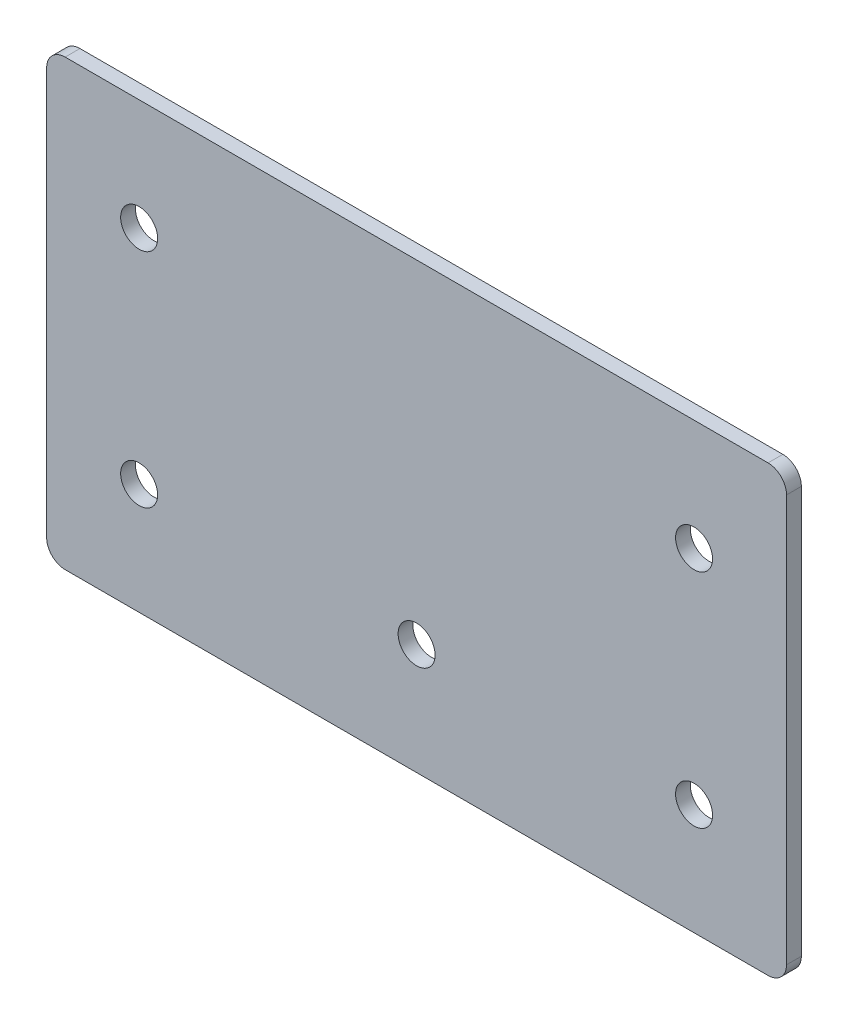
ISO-10303-21;
HEADER;
FILE_DESCRIPTION(('STEP AP214'),'2;1');
FILE_NAME('part.step','',(''),(''),'','','');
FILE_SCHEMA(('AUTOMOTIVE_DESIGN { 1 0 10303 214 1 1 1 1 }'));
ENDSEC;
DATA;
#1=APPLICATION_CONTEXT('core data for automotive mechanical design processes');
#2=APPLICATION_PROTOCOL_DEFINITION('international standard','automotive_design',2000,#1);
#3=PRODUCT_CONTEXT('',#1,'mechanical');
#4=PRODUCT('Part','Part','',(#3));
#5=PRODUCT_RELATED_PRODUCT_CATEGORY('part','',(#4));
#6=PRODUCT_DEFINITION_FORMATION('','',#4);
#7=PRODUCT_DEFINITION_CONTEXT('part definition',#1,'design');
#8=PRODUCT_DEFINITION('design','',#6,#7);
#9=PRODUCT_DEFINITION_SHAPE('','',#8);
#10=(LENGTH_UNIT() NAMED_UNIT(*) SI_UNIT(.MILLI.,.METRE.));
#11=(NAMED_UNIT(*) PLANE_ANGLE_UNIT() SI_UNIT($,.RADIAN.));
#12=(NAMED_UNIT(*) SI_UNIT($,.STERADIAN.) SOLID_ANGLE_UNIT());
#13=UNCERTAINTY_MEASURE_WITH_UNIT(LENGTH_MEASURE(1.E-05),#10,'distance_accuracy_value','');
#14=(GEOMETRIC_REPRESENTATION_CONTEXT(3) GLOBAL_UNCERTAINTY_ASSIGNED_CONTEXT((#13)) GLOBAL_UNIT_ASSIGNED_CONTEXT((#10,
#11,#12)) REPRESENTATION_CONTEXT('',''));
#15=CARTESIAN_POINT('',(0.,0.,0.));
#16=DIRECTION('',(0.,0.,1.));
#17=DIRECTION('',(1.,0.,0.));
#18=AXIS2_PLACEMENT_3D('',#15,#16,#17);
#19=CARTESIAN_POINT('',(0.,0.,16.7000000000001));
#20=DIRECTION('',(0.,0.,-1.));
#21=DIRECTION('',(-1.,0.,0.));
#22=AXIS2_PLACEMENT_3D('',#19,#20,#21);
#23=PLANE('',#22);
#24=DIRECTION('',(0.,1.,0.));
#25=VECTOR('',#24,1.);
#26=CARTESIAN_POINT('',(1066.080087664,115.697979581785,16.7000000000001));
#27=LINE('',#26,#25);
#28=CARTESIAN_POINT('',(1066.080087664,120.697979581785,16.7000000000001));
#29=VERTEX_POINT('',#28);
#30=CARTESIAN_POINT('',(1066.080087664,230.697979581784,16.7000000000001));
#31=VERTEX_POINT('',#30);
#32=EDGE_CURVE('E165',#29,#31,#27,.T.);
#33=ORIENTED_EDGE('',*,*,#32,.T.);
#34=CARTESIAN_POINT('',(1061.080087664,230.697979581784,16.7000000000001));
#35=DIRECTION('',(0.,0.,-1.));
#36=DIRECTION('',(-1.,0.,0.));
#37=AXIS2_PLACEMENT_3D('',#34,#35,#36);
#38=CIRCLE('',#37,5.);
#39=CARTESIAN_POINT('',(1061.080087664,235.697979581784,16.7000000000001));
#40=VERTEX_POINT('',#39);
#41=EDGE_CURVE('E148',#31,#40,#38,.F.);
#42=ORIENTED_EDGE('',*,*,#41,.T.);
#43=DIRECTION('',(-1.,0.,0.));
#44=VECTOR('',#43,1.);
#45=CARTESIAN_POINT('',(866.08010083132,235.697979581784,16.7000000000001));
#46=LINE('',#45,#44);
#47=CARTESIAN_POINT('',(871.08010083132,235.697979581784,16.7000000000001));
#48=VERTEX_POINT('',#47);
#49=EDGE_CURVE('E119',#40,#48,#46,.T.);
#50=ORIENTED_EDGE('',*,*,#49,.T.);
#51=CARTESIAN_POINT('',(871.08010083132,230.697979581784,16.7000000000001));
#52=DIRECTION('',(0.,0.,-1.));
#53=DIRECTION('',(-1.,0.,0.));
#54=AXIS2_PLACEMENT_3D('',#51,#52,#53);
#55=CIRCLE('',#54,5.);
#56=CARTESIAN_POINT('',(866.08010083132,230.697979581784,16.7000000000001));
#57=VERTEX_POINT('',#56);
#58=EDGE_CURVE('E146',#48,#57,#55,.F.);
#59=ORIENTED_EDGE('',*,*,#58,.T.);
#60=DIRECTION('',(0.,-1.,0.));
#61=VECTOR('',#60,1.);
#62=CARTESIAN_POINT('',(866.08010083132,115.697979581785,16.7000000000001));
#63=LINE('',#62,#61);
#64=CARTESIAN_POINT('',(866.08010083132,120.697979581785,16.7000000000001));
#65=VERTEX_POINT('',#64);
#66=EDGE_CURVE('E126',#57,#65,#63,.T.);
#67=ORIENTED_EDGE('',*,*,#66,.T.);
#68=CARTESIAN_POINT('',(871.08010083132,120.697979581785,16.7000000000001));
#69=DIRECTION('',(0.,0.,-1.));
#70=DIRECTION('',(-1.,0.,0.));
#71=AXIS2_PLACEMENT_3D('',#68,#69,#70);
#72=CIRCLE('',#71,5.);
#73=CARTESIAN_POINT('',(871.08010083132,115.697979581785,16.7000000000001));
#74=VERTEX_POINT('',#73);
#75=EDGE_CURVE('E54',#65,#74,#72,.F.);
#76=ORIENTED_EDGE('',*,*,#75,.T.);
#77=DIRECTION('',(1.,0.,0.));
#78=VECTOR('',#77,1.);
#79=CARTESIAN_POINT('',(866.08010083132,115.697979581785,16.7000000000001));
#80=LINE('',#79,#78);
#81=CARTESIAN_POINT('',(1061.080087664,115.697979581785,16.7000000000001));
#82=VERTEX_POINT('',#81);
#83=EDGE_CURVE('E129',#74,#82,#80,.T.);
#84=ORIENTED_EDGE('',*,*,#83,.T.);
#85=CARTESIAN_POINT('',(1061.080087664,120.697979581785,16.7000000000001));
#86=DIRECTION('',(0.,0.,-1.));
#87=DIRECTION('',(-1.,0.,0.));
#88=AXIS2_PLACEMENT_3D('',#85,#86,#87);
#89=CIRCLE('',#88,5.);
#90=EDGE_CURVE('E144',#82,#29,#89,.F.);
#91=ORIENTED_EDGE('',*,*,#90,.T.);
#92=EDGE_LOOP('',(#33,#42,#50,#59,#67,#76,#84,#91));
#93=FACE_BOUND('',#92,.T.);
#94=CARTESIAN_POINT('',(891.080087664001,205.697979581784,16.7000000000001));
#95=DIRECTION('',(0.,0.,1.));
#96=DIRECTION('',(1.,0.,0.));
#97=AXIS2_PLACEMENT_3D('',#94,#95,#96);
#98=CIRCLE('',#97,5.00000000000017);
#99=CARTESIAN_POINT('',(896.080087664001,205.697979581784,16.7000000000001));
#100=VERTEX_POINT('',#99);
#101=EDGE_CURVE('E161',#100,#100,#98,.T.);
#102=ORIENTED_EDGE('',*,*,#101,.F.);
#103=EDGE_LOOP('',(#102));
#104=FACE_BOUND('',#103,.T.);
#105=CARTESIAN_POINT('',(1041.080087664,205.697979581784,16.7000000000001));
#106=DIRECTION('',(0.,0.,1.));
#107=DIRECTION('',(1.,0.,0.));
#108=AXIS2_PLACEMENT_3D('',#105,#106,#107);
#109=CIRCLE('',#108,5.00000000000007);
#110=CARTESIAN_POINT('',(1046.080087664,205.697979581784,16.7000000000001));
#111=VERTEX_POINT('',#110);
#112=EDGE_CURVE('E172',#111,#111,#109,.T.);
#113=ORIENTED_EDGE('',*,*,#112,.F.);
#114=EDGE_LOOP('',(#113));
#115=FACE_BOUND('',#114,.T.);
#116=CARTESIAN_POINT('',(891.080087664,145.697979581784,16.7000000000001));
#117=DIRECTION('',(0.,0.,1.));
#118=DIRECTION('',(1.,0.,0.));
#119=AXIS2_PLACEMENT_3D('',#116,#117,#118);
#120=CIRCLE('',#119,5.00000000000006);
#121=CARTESIAN_POINT('',(896.080087664,145.697979581784,16.7000000000001));
#122=VERTEX_POINT('',#121);
#123=EDGE_CURVE('E178',#122,#122,#120,.T.);
#124=ORIENTED_EDGE('',*,*,#123,.F.);
#125=EDGE_LOOP('',(#124));
#126=FACE_BOUND('',#125,.T.);
#127=CARTESIAN_POINT('',(966.080087664,145.697979581784,16.7000000000001));
#128=DIRECTION('',(0.,0.,1.));
#129=DIRECTION('',(1.,0.,0.));
#130=AXIS2_PLACEMENT_3D('',#127,#128,#129);
#131=CIRCLE('',#130,5.00000000000006);
#132=CARTESIAN_POINT('',(971.080087664,145.697979581784,16.7000000000001));
#133=VERTEX_POINT('',#132);
#134=EDGE_CURVE('E184',#133,#133,#131,.T.);
#135=ORIENTED_EDGE('',*,*,#134,.F.);
#136=EDGE_LOOP('',(#135));
#137=FACE_BOUND('',#136,.T.);
#138=CARTESIAN_POINT('',(1041.080087664,145.697979581784,16.7000000000001));
#139=DIRECTION('',(0.,0.,1.));
#140=DIRECTION('',(1.,0.,0.));
#141=AXIS2_PLACEMENT_3D('',#138,#139,#140);
#142=CIRCLE('',#141,5.00000000000007);
#143=CARTESIAN_POINT('',(1046.080087664,145.697979581784,16.7000000000001));
#144=VERTEX_POINT('',#143);
#145=EDGE_CURVE('E190',#144,#144,#142,.T.);
#146=ORIENTED_EDGE('',*,*,#145,.F.);
#147=EDGE_LOOP('',(#146));
#148=FACE_BOUND('',#147,.T.);
#149=ADVANCED_FACE('F34',(#93,#104,#115,#126,#137,#148),#23,.F.);
#150=CARTESIAN_POINT('',(0.,0.,12.7000000000001));
#151=DIRECTION('',(0.,0.,-1.));
#152=DIRECTION('',(-1.,0.,0.));
#153=AXIS2_PLACEMENT_3D('',#150,#151,#152);
#154=PLANE('',#153);
#155=CARTESIAN_POINT('',(966.080087664,145.697979581784,12.7000000000001));
#156=DIRECTION('',(0.,0.,1.));
#157=DIRECTION('',(1.,0.,0.));
#158=AXIS2_PLACEMENT_3D('',#155,#156,#157);
#159=CIRCLE('',#158,5.00000000000006);
#160=CARTESIAN_POINT('',(971.080087664,145.697979581784,12.7000000000001));
#161=VERTEX_POINT('',#160);
#162=EDGE_CURVE('E187',#161,#161,#159,.T.);
#163=ORIENTED_EDGE('',*,*,#162,.T.);
#164=EDGE_LOOP('',(#163));
#165=FACE_BOUND('',#164,.T.);
#166=CARTESIAN_POINT('',(1041.080087664,205.697979581784,12.7000000000001));
#167=DIRECTION('',(0.,0.,1.));
#168=DIRECTION('',(1.,0.,0.));
#169=AXIS2_PLACEMENT_3D('',#166,#167,#168);
#170=CIRCLE('',#169,5.00000000000007);
#171=CARTESIAN_POINT('',(1046.080087664,205.697979581784,12.7000000000001));
#172=VERTEX_POINT('',#171);
#173=EDGE_CURVE('E175',#172,#172,#170,.T.);
#174=ORIENTED_EDGE('',*,*,#173,.T.);
#175=EDGE_LOOP('',(#174));
#176=FACE_BOUND('',#175,.T.);
#177=DIRECTION('',(-1.,0.,0.));
#178=VECTOR('',#177,1.);
#179=CARTESIAN_POINT('',(866.08010083132,235.697979581784,12.7000000000001));
#180=LINE('',#179,#178);
#181=CARTESIAN_POINT('',(1061.080087664,235.697979581784,12.7000000000001));
#182=VERTEX_POINT('',#181);
#183=CARTESIAN_POINT('',(871.08010083132,235.697979581784,12.7000000000001));
#184=VERTEX_POINT('',#183);
#185=EDGE_CURVE('E116',#182,#184,#180,.T.);
#186=ORIENTED_EDGE('',*,*,#185,.F.);
#187=CARTESIAN_POINT('',(1061.080087664,230.697979581784,12.7000000000001));
#188=DIRECTION('',(0.,0.,-1.));
#189=DIRECTION('',(-1.,0.,0.));
#190=AXIS2_PLACEMENT_3D('',#187,#188,#189);
#191=CIRCLE('',#190,5.);
#192=CARTESIAN_POINT('',(1066.080087664,230.697979581784,12.7000000000001));
#193=VERTEX_POINT('',#192);
#194=EDGE_CURVE('E99',#182,#193,#191,.T.);
#195=ORIENTED_EDGE('',*,*,#194,.T.);
#196=DIRECTION('',(0.,1.,0.));
#197=VECTOR('',#196,1.);
#198=CARTESIAN_POINT('',(1066.080087664,115.697979581785,12.7000000000001));
#199=LINE('',#198,#197);
#200=CARTESIAN_POINT('',(1066.080087664,120.697979581785,12.7000000000001));
#201=VERTEX_POINT('',#200);
#202=EDGE_CURVE('E127',#201,#193,#199,.T.);
#203=ORIENTED_EDGE('',*,*,#202,.F.);
#204=CARTESIAN_POINT('',(1061.080087664,120.697979581785,12.7000000000001));
#205=DIRECTION('',(0.,0.,-1.));
#206=DIRECTION('',(-1.,0.,0.));
#207=AXIS2_PLACEMENT_3D('',#204,#205,#206);
#208=CIRCLE('',#207,5.);
#209=CARTESIAN_POINT('',(1061.080087664,115.697979581785,12.7000000000001));
#210=VERTEX_POINT('',#209);
#211=EDGE_CURVE('E137',#201,#210,#208,.T.);
#212=ORIENTED_EDGE('',*,*,#211,.T.);
#213=DIRECTION('',(1.,0.,0.));
#214=VECTOR('',#213,1.);
#215=CARTESIAN_POINT('',(866.08010083132,115.697979581785,12.7000000000001));
#216=LINE('',#215,#214);
#217=CARTESIAN_POINT('',(871.08010083132,115.697979581785,12.7000000000001));
#218=VERTEX_POINT('',#217);
#219=EDGE_CURVE('E131',#218,#210,#216,.T.);
#220=ORIENTED_EDGE('',*,*,#219,.F.);
#221=CARTESIAN_POINT('',(871.08010083132,120.697979581785,12.7000000000001));
#222=DIRECTION('',(0.,0.,-1.));
#223=DIRECTION('',(-1.,0.,0.));
#224=AXIS2_PLACEMENT_3D('',#221,#222,#223);
#225=CIRCLE('',#224,5.);
#226=CARTESIAN_POINT('',(866.08010083132,120.697979581785,12.7000000000001));
#227=VERTEX_POINT('',#226);
#228=EDGE_CURVE('E120',#218,#227,#225,.T.);
#229=ORIENTED_EDGE('',*,*,#228,.T.);
#230=DIRECTION('',(0.,-1.,0.));
#231=VECTOR('',#230,1.);
#232=CARTESIAN_POINT('',(866.08010083132,115.697979581785,12.7000000000001));
#233=LINE('',#232,#231);
#234=CARTESIAN_POINT('',(866.08010083132,230.697979581784,12.7000000000001));
#235=VERTEX_POINT('',#234);
#236=EDGE_CURVE('E160',#235,#227,#233,.T.);
#237=ORIENTED_EDGE('',*,*,#236,.F.);
#238=CARTESIAN_POINT('',(871.08010083132,230.697979581784,12.7000000000001));
#239=DIRECTION('',(0.,0.,-1.));
#240=DIRECTION('',(-1.,0.,0.));
#241=AXIS2_PLACEMENT_3D('',#238,#239,#240);
#242=CIRCLE('',#241,5.);
#243=EDGE_CURVE('E110',#235,#184,#242,.T.);
#244=ORIENTED_EDGE('',*,*,#243,.T.);
#245=EDGE_LOOP('',(#186,#195,#203,#212,#220,#229,#237,#244));
#246=FACE_BOUND('',#245,.T.);
#247=CARTESIAN_POINT('',(891.080087664001,205.697979581784,12.7000000000001));
#248=DIRECTION('',(0.,0.,1.));
#249=DIRECTION('',(1.,0.,0.));
#250=AXIS2_PLACEMENT_3D('',#247,#248,#249);
#251=CIRCLE('',#250,5.00000000000017);
#252=CARTESIAN_POINT('',(896.080087664001,205.697979581784,12.7000000000001));
#253=VERTEX_POINT('',#252);
#254=EDGE_CURVE('E169',#253,#253,#251,.T.);
#255=ORIENTED_EDGE('',*,*,#254,.T.);
#256=EDGE_LOOP('',(#255));
#257=FACE_BOUND('',#256,.T.);
#258=CARTESIAN_POINT('',(891.080087664,145.697979581784,12.7000000000001));
#259=DIRECTION('',(0.,0.,1.));
#260=DIRECTION('',(1.,0.,0.));
#261=AXIS2_PLACEMENT_3D('',#258,#259,#260);
#262=CIRCLE('',#261,5.00000000000006);
#263=CARTESIAN_POINT('',(896.080087664,145.697979581784,12.7000000000001));
#264=VERTEX_POINT('',#263);
#265=EDGE_CURVE('E181',#264,#264,#262,.T.);
#266=ORIENTED_EDGE('',*,*,#265,.T.);
#267=EDGE_LOOP('',(#266));
#268=FACE_BOUND('',#267,.T.);
#269=CARTESIAN_POINT('',(1041.080087664,145.697979581784,12.7000000000001));
#270=DIRECTION('',(0.,0.,1.));
#271=DIRECTION('',(1.,0.,0.));
#272=AXIS2_PLACEMENT_3D('',#269,#270,#271);
#273=CIRCLE('',#272,5.00000000000007);
#274=CARTESIAN_POINT('',(1046.080087664,145.697979581784,12.7000000000001));
#275=VERTEX_POINT('',#274);
#276=EDGE_CURVE('E193',#275,#275,#273,.T.);
#277=ORIENTED_EDGE('',*,*,#276,.T.);
#278=EDGE_LOOP('',(#277));
#279=FACE_BOUND('',#278,.T.);
#280=ADVANCED_FACE('F123',(#165,#176,#246,#257,#268,#279),#154,.T.);
#281=CARTESIAN_POINT('',(866.08010083132,115.697979581785,16.7000000000001));
#282=DIRECTION('',(1.,0.,0.));
#283=DIRECTION('',(0.,0.,-1.));
#284=AXIS2_PLACEMENT_3D('',#281,#282,#283);
#285=PLANE('',#284);
#286=ORIENTED_EDGE('',*,*,#66,.F.);
#287=DIRECTION('',(0.,0.,-1.));
#288=VECTOR('',#287,1.);
#289=CARTESIAN_POINT('',(866.08010083132,230.697979581784,16.7000000000001));
#290=LINE('',#289,#288);
#291=EDGE_CURVE('E152',#57,#235,#290,.T.);
#292=ORIENTED_EDGE('',*,*,#291,.T.);
#293=ORIENTED_EDGE('',*,*,#236,.T.);
#294=DIRECTION('',(0.,0.,-1.));
#295=VECTOR('',#294,1.);
#296=CARTESIAN_POINT('',(866.08010083132,120.697979581785,16.7000000000001));
#297=LINE('',#296,#295);
#298=EDGE_CURVE('E150',#227,#65,#297,.F.);
#299=ORIENTED_EDGE('',*,*,#298,.T.);
#300=EDGE_LOOP('',(#286,#292,#293,#299));
#301=FACE_BOUND('',#300,.T.);
#302=ADVANCED_FACE('F207',(#301),#285,.F.);
#303=CARTESIAN_POINT('',(866.08010083132,115.697979581785,16.7000000000001));
#304=DIRECTION('',(0.,1.,0.));
#305=DIRECTION('',(0.,0.,1.));
#306=AXIS2_PLACEMENT_3D('',#303,#304,#305);
#307=PLANE('',#306);
#308=ORIENTED_EDGE('',*,*,#219,.T.);
#309=DIRECTION('',(0.,0.,-1.));
#310=VECTOR('',#309,1.);
#311=CARTESIAN_POINT('',(1061.080087664,115.697979581785,16.7000000000001));
#312=LINE('',#311,#310);
#313=EDGE_CURVE('E11',#210,#82,#312,.F.);
#314=ORIENTED_EDGE('',*,*,#313,.T.);
#315=ORIENTED_EDGE('',*,*,#83,.F.);
#316=DIRECTION('',(0.,0.,-1.));
#317=VECTOR('',#316,1.);
#318=CARTESIAN_POINT('',(871.08010083132,115.697979581785,16.7000000000001));
#319=LINE('',#318,#317);
#320=EDGE_CURVE('E42',#74,#218,#319,.T.);
#321=ORIENTED_EDGE('',*,*,#320,.T.);
#322=EDGE_LOOP('',(#308,#314,#315,#321));
#323=FACE_BOUND('',#322,.T.);
#324=ADVANCED_FACE('F157',(#323),#307,.F.);
#325=CARTESIAN_POINT('',(1066.080087664,115.697979581785,16.7000000000001));
#326=DIRECTION('',(-1.,0.,0.));
#327=DIRECTION('',(0.,0.,1.));
#328=AXIS2_PLACEMENT_3D('',#325,#326,#327);
#329=PLANE('',#328);
#330=ORIENTED_EDGE('',*,*,#202,.T.);
#331=DIRECTION('',(0.,0.,-1.));
#332=VECTOR('',#331,1.);
#333=CARTESIAN_POINT('',(1066.080087664,230.697979581784,16.7000000000001));
#334=LINE('',#333,#332);
#335=EDGE_CURVE('E104',#193,#31,#334,.F.);
#336=ORIENTED_EDGE('',*,*,#335,.T.);
#337=ORIENTED_EDGE('',*,*,#32,.F.);
#338=DIRECTION('',(0.,0.,-1.));
#339=VECTOR('',#338,1.);
#340=CARTESIAN_POINT('',(1066.080087664,120.697979581785,16.7000000000001));
#341=LINE('',#340,#339);
#342=EDGE_CURVE('E109',#29,#201,#341,.T.);
#343=ORIENTED_EDGE('',*,*,#342,.T.);
#344=EDGE_LOOP('',(#330,#336,#337,#343));
#345=FACE_BOUND('',#344,.T.);
#346=ADVANCED_FACE('F217',(#345),#329,.F.);
#347=CARTESIAN_POINT('',(866.08010083132,235.697979581784,16.7000000000001));
#348=DIRECTION('',(0.,-1.,0.));
#349=DIRECTION('',(0.,0.,-1.));
#350=AXIS2_PLACEMENT_3D('',#347,#348,#349);
#351=PLANE('',#350);
#352=ORIENTED_EDGE('',*,*,#49,.F.);
#353=DIRECTION('',(0.,0.,-1.));
#354=VECTOR('',#353,1.);
#355=CARTESIAN_POINT('',(1061.080087664,235.697979581784,16.7000000000001));
#356=LINE('',#355,#354);
#357=EDGE_CURVE('E103',#40,#182,#356,.T.);
#358=ORIENTED_EDGE('',*,*,#357,.T.);
#359=ORIENTED_EDGE('',*,*,#185,.T.);
#360=DIRECTION('',(0.,0.,-1.));
#361=VECTOR('',#360,1.);
#362=CARTESIAN_POINT('',(871.08010083132,235.697979581784,16.7000000000001));
#363=LINE('',#362,#361);
#364=EDGE_CURVE('E121',#184,#48,#363,.F.);
#365=ORIENTED_EDGE('',*,*,#364,.T.);
#366=EDGE_LOOP('',(#352,#358,#359,#365));
#367=FACE_BOUND('',#366,.T.);
#368=ADVANCED_FACE('F115',(#367),#351,.F.);
#369=CARTESIAN_POINT('',(891.080087664001,205.697979581784,16.7000000000001));
#370=DIRECTION('',(0.,0.,-1.));
#371=DIRECTION('',(-1.,0.,0.));
#372=AXIS2_PLACEMENT_3D('',#369,#370,#371);
#373=CYLINDRICAL_SURFACE('',#372,5.00000000000017);
#374=ORIENTED_EDGE('',*,*,#101,.T.);
#375=EDGE_LOOP('',(#374));
#376=FACE_BOUND('',#375,.T.);
#377=ORIENTED_EDGE('',*,*,#254,.F.);
#378=EDGE_LOOP('',(#377));
#379=FACE_BOUND('',#378,.T.);
#380=ADVANCED_FACE('F212',(#376,#379),#373,.F.);
#381=CARTESIAN_POINT('',(1041.080087664,205.697979581784,16.7000000000001));
#382=DIRECTION('',(0.,0.,-1.));
#383=DIRECTION('',(-1.,0.,0.));
#384=AXIS2_PLACEMENT_3D('',#381,#382,#383);
#385=CYLINDRICAL_SURFACE('',#384,5.00000000000007);
#386=ORIENTED_EDGE('',*,*,#112,.T.);
#387=EDGE_LOOP('',(#386));
#388=FACE_BOUND('',#387,.T.);
#389=ORIENTED_EDGE('',*,*,#173,.F.);
#390=EDGE_LOOP('',(#389));
#391=FACE_BOUND('',#390,.T.);
#392=ADVANCED_FACE('F290',(#388,#391),#385,.F.);
#393=CARTESIAN_POINT('',(891.080087664,145.697979581784,16.7000000000001));
#394=DIRECTION('',(0.,0.,-1.));
#395=DIRECTION('',(-1.,0.,0.));
#396=AXIS2_PLACEMENT_3D('',#393,#394,#395);
#397=CYLINDRICAL_SURFACE('',#396,5.00000000000006);
#398=ORIENTED_EDGE('',*,*,#123,.T.);
#399=EDGE_LOOP('',(#398));
#400=FACE_BOUND('',#399,.T.);
#401=ORIENTED_EDGE('',*,*,#265,.F.);
#402=EDGE_LOOP('',(#401));
#403=FACE_BOUND('',#402,.T.);
#404=ADVANCED_FACE('F280',(#400,#403),#397,.F.);
#405=CARTESIAN_POINT('',(966.080087664,145.697979581784,16.7000000000001));
#406=DIRECTION('',(0.,0.,-1.));
#407=DIRECTION('',(-1.,0.,0.));
#408=AXIS2_PLACEMENT_3D('',#405,#406,#407);
#409=CYLINDRICAL_SURFACE('',#408,5.00000000000006);
#410=ORIENTED_EDGE('',*,*,#134,.T.);
#411=EDGE_LOOP('',(#410));
#412=FACE_BOUND('',#411,.T.);
#413=ORIENTED_EDGE('',*,*,#162,.F.);
#414=EDGE_LOOP('',(#413));
#415=FACE_BOUND('',#414,.T.);
#416=ADVANCED_FACE('F271',(#412,#415),#409,.F.);
#417=CARTESIAN_POINT('',(1041.080087664,145.697979581784,16.7000000000001));
#418=DIRECTION('',(0.,0.,-1.));
#419=DIRECTION('',(-1.,0.,0.));
#420=AXIS2_PLACEMENT_3D('',#417,#418,#419);
#421=CYLINDRICAL_SURFACE('',#420,5.00000000000007);
#422=ORIENTED_EDGE('',*,*,#145,.T.);
#423=EDGE_LOOP('',(#422));
#424=FACE_BOUND('',#423,.T.);
#425=ORIENTED_EDGE('',*,*,#276,.F.);
#426=EDGE_LOOP('',(#425));
#427=FACE_BOUND('',#426,.T.);
#428=ADVANCED_FACE('F199',(#424,#427),#421,.F.);
#429=CARTESIAN_POINT('',(1061.080087664,230.697979581784,16.7000000000001));
#430=DIRECTION('',(0.,0.,-1.));
#431=DIRECTION('',(-1.,0.,0.));
#432=AXIS2_PLACEMENT_3D('',#429,#430,#431);
#433=CYLINDRICAL_SURFACE('',#432,5.);
#434=ORIENTED_EDGE('',*,*,#41,.F.);
#435=ORIENTED_EDGE('',*,*,#335,.F.);
#436=ORIENTED_EDGE('',*,*,#194,.F.);
#437=ORIENTED_EDGE('',*,*,#357,.F.);
#438=EDGE_LOOP('',(#434,#435,#436,#437));
#439=FACE_BOUND('',#438,.T.);
#440=ADVANCED_FACE('F102',(#439),#433,.T.);
#441=CARTESIAN_POINT('',(871.08010083132,230.697979581784,16.7000000000001));
#442=DIRECTION('',(0.,0.,-1.));
#443=DIRECTION('',(-1.,0.,0.));
#444=AXIS2_PLACEMENT_3D('',#441,#442,#443);
#445=CYLINDRICAL_SURFACE('',#444,5.);
#446=ORIENTED_EDGE('',*,*,#58,.F.);
#447=ORIENTED_EDGE('',*,*,#364,.F.);
#448=ORIENTED_EDGE('',*,*,#243,.F.);
#449=ORIENTED_EDGE('',*,*,#291,.F.);
#450=EDGE_LOOP('',(#446,#447,#448,#449));
#451=FACE_BOUND('',#450,.T.);
#452=ADVANCED_FACE('F228',(#451),#445,.T.);
#453=CARTESIAN_POINT('',(1061.080087664,120.697979581785,16.7000000000001));
#454=DIRECTION('',(0.,0.,-1.));
#455=DIRECTION('',(-1.,0.,0.));
#456=AXIS2_PLACEMENT_3D('',#453,#454,#455);
#457=CYLINDRICAL_SURFACE('',#456,5.);
#458=ORIENTED_EDGE('',*,*,#90,.F.);
#459=ORIENTED_EDGE('',*,*,#313,.F.);
#460=ORIENTED_EDGE('',*,*,#211,.F.);
#461=ORIENTED_EDGE('',*,*,#342,.F.);
#462=EDGE_LOOP('',(#458,#459,#460,#461));
#463=FACE_BOUND('',#462,.T.);
#464=ADVANCED_FACE('F230',(#463),#457,.T.);
#465=CARTESIAN_POINT('',(871.08010083132,120.697979581785,16.7000000000001));
#466=DIRECTION('',(0.,0.,-1.));
#467=DIRECTION('',(-1.,0.,0.));
#468=AXIS2_PLACEMENT_3D('',#465,#466,#467);
#469=CYLINDRICAL_SURFACE('',#468,5.);
#470=ORIENTED_EDGE('',*,*,#75,.F.);
#471=ORIENTED_EDGE('',*,*,#298,.F.);
#472=ORIENTED_EDGE('',*,*,#228,.F.);
#473=ORIENTED_EDGE('',*,*,#320,.F.);
#474=EDGE_LOOP('',(#470,#471,#472,#473));
#475=FACE_BOUND('',#474,.T.);
#476=ADVANCED_FACE('F36',(#475),#469,.T.);
#477=CLOSED_SHELL('',(#149,#280,#302,#324,#346,#368,#380,#392,#404,#416,#428,#440,#452,#464,#476));
#478=MANIFOLD_SOLID_BREP('B2',#477);
#479=ADVANCED_BREP_SHAPE_REPRESENTATION('',(#18,#478),#14);
#480=SHAPE_DEFINITION_REPRESENTATION(#9,#479);
ENDSEC;
END-ISO-10303-21;
